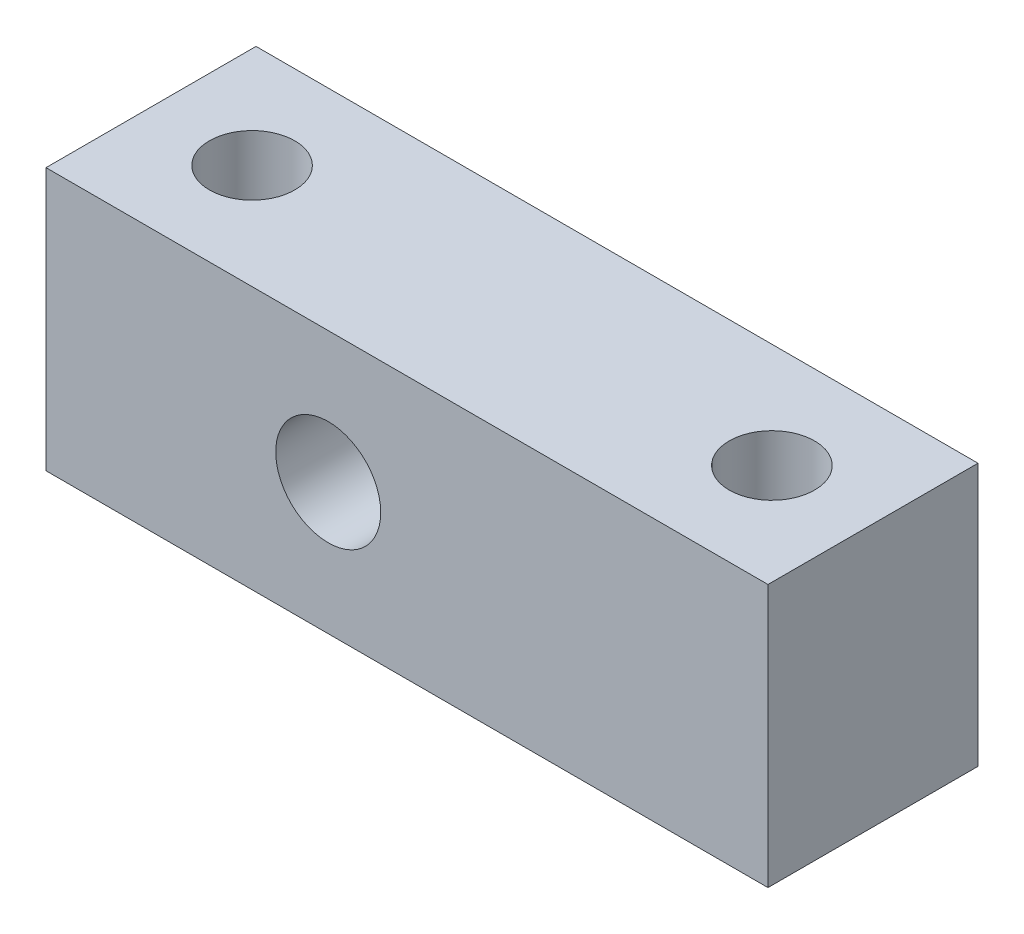
ISO-10303-21;
HEADER;
FILE_DESCRIPTION(('STEP AP214'),'2;1');
FILE_NAME('part.step','',(''),(''),'','','');
FILE_SCHEMA(('AUTOMOTIVE_DESIGN { 1 0 10303 214 1 1 1 1 }'));
ENDSEC;
DATA;
#1=APPLICATION_CONTEXT('core data for automotive mechanical design processes');
#2=APPLICATION_PROTOCOL_DEFINITION('international standard','automotive_design',2000,#1);
#3=PRODUCT_CONTEXT('',#1,'mechanical');
#4=PRODUCT('Part','Part','',(#3));
#5=PRODUCT_RELATED_PRODUCT_CATEGORY('part','',(#4));
#6=PRODUCT_DEFINITION_FORMATION('','',#4);
#7=PRODUCT_DEFINITION_CONTEXT('part definition',#1,'design');
#8=PRODUCT_DEFINITION('design','',#6,#7);
#9=PRODUCT_DEFINITION_SHAPE('','',#8);
#10=(LENGTH_UNIT() NAMED_UNIT(*) SI_UNIT(.MILLI.,.METRE.));
#11=(NAMED_UNIT(*) PLANE_ANGLE_UNIT() SI_UNIT($,.RADIAN.));
#12=(NAMED_UNIT(*) SI_UNIT($,.STERADIAN.) SOLID_ANGLE_UNIT());
#13=UNCERTAINTY_MEASURE_WITH_UNIT(LENGTH_MEASURE(1.E-05),#10,'distance_accuracy_value','');
#14=(GEOMETRIC_REPRESENTATION_CONTEXT(3) GLOBAL_UNCERTAINTY_ASSIGNED_CONTEXT((#13)) GLOBAL_UNIT_ASSIGNED_CONTEXT((#10,
#11,#12)) REPRESENTATION_CONTEXT('',''));
#15=CARTESIAN_POINT('',(0.,0.,0.));
#16=DIRECTION('',(0.,0.,1.));
#17=DIRECTION('',(1.,0.,0.));
#18=AXIS2_PLACEMENT_3D('',#15,#16,#17);
#19=CARTESIAN_POINT('',(27.5,-10.,16.));
#20=DIRECTION('',(-1.,0.,0.));
#21=DIRECTION('',(0.,0.,1.));
#22=AXIS2_PLACEMENT_3D('',#19,#20,#21);
#23=PLANE('',#22);
#24=DIRECTION('',(0.,1.,0.));
#25=VECTOR('',#24,1.);
#26=CARTESIAN_POINT('',(27.5,-10.,0.));
#27=LINE('',#26,#25);
#28=CARTESIAN_POINT('',(27.5,-10.,0.));
#29=VERTEX_POINT('',#28);
#30=CARTESIAN_POINT('',(27.5,10.,0.));
#31=VERTEX_POINT('',#30);
#32=EDGE_CURVE('E100',#29,#31,#27,.T.);
#33=ORIENTED_EDGE('',*,*,#32,.T.);
#34=DIRECTION('',(0.,0.,-1.));
#35=VECTOR('',#34,1.);
#36=CARTESIAN_POINT('',(27.5,10.,16.));
#37=LINE('',#36,#35);
#38=CARTESIAN_POINT('',(27.5,10.,16.));
#39=VERTEX_POINT('',#38);
#40=EDGE_CURVE('E11',#39,#31,#37,.T.);
#41=ORIENTED_EDGE('',*,*,#40,.F.);
#42=DIRECTION('',(0.,1.,0.));
#43=VECTOR('',#42,1.);
#44=CARTESIAN_POINT('',(27.5,-10.,16.));
#45=LINE('',#44,#43);
#46=CARTESIAN_POINT('',(27.5,-10.,16.));
#47=VERTEX_POINT('',#46);
#48=EDGE_CURVE('E87',#47,#39,#45,.T.);
#49=ORIENTED_EDGE('',*,*,#48,.F.);
#50=DIRECTION('',(0.,0.,-1.));
#51=VECTOR('',#50,1.);
#52=CARTESIAN_POINT('',(27.5,-10.,16.));
#53=LINE('',#52,#51);
#54=EDGE_CURVE('E96',#47,#29,#53,.T.);
#55=ORIENTED_EDGE('',*,*,#54,.T.);
#56=EDGE_LOOP('',(#33,#41,#49,#55));
#57=FACE_BOUND('',#56,.T.);
#58=ADVANCED_FACE('F35',(#57),#23,.F.);
#59=CARTESIAN_POINT('',(-27.5,10.,16.));
#60=DIRECTION('',(0.,-1.,0.));
#61=DIRECTION('',(0.,0.,-1.));
#62=AXIS2_PLACEMENT_3D('',#59,#60,#61);
#63=PLANE('',#62);
#64=CARTESIAN_POINT('',(19.8,10.,8.));
#65=DIRECTION('',(0.,1.,0.));
#66=DIRECTION('',(0.,0.,1.));
#67=AXIS2_PLACEMENT_3D('',#64,#65,#66);
#68=CIRCLE('',#67,3.25);
#69=CARTESIAN_POINT('',(19.8,10.,11.25));
#70=VERTEX_POINT('',#69);
#71=EDGE_CURVE('E125',#70,#70,#68,.T.);
#72=ORIENTED_EDGE('',*,*,#71,.F.);
#73=EDGE_LOOP('',(#72));
#74=FACE_BOUND('',#73,.T.);
#75=CARTESIAN_POINT('',(-19.8,10.,8.));
#76=DIRECTION('',(0.,1.,0.));
#77=DIRECTION('',(0.,0.,1.));
#78=AXIS2_PLACEMENT_3D('',#75,#76,#77);
#79=CIRCLE('',#78,3.25);
#80=CARTESIAN_POINT('',(-19.8,10.,11.25));
#81=VERTEX_POINT('',#80);
#82=EDGE_CURVE('E119',#81,#81,#79,.T.);
#83=ORIENTED_EDGE('',*,*,#82,.F.);
#84=EDGE_LOOP('',(#83));
#85=FACE_BOUND('',#84,.T.);
#86=DIRECTION('',(-1.,0.,0.));
#87=VECTOR('',#86,1.);
#88=CARTESIAN_POINT('',(-27.5,10.,0.));
#89=LINE('',#88,#87);
#90=CARTESIAN_POINT('',(-27.5,10.,0.));
#91=VERTEX_POINT('',#90);
#92=EDGE_CURVE('E91',#31,#91,#89,.T.);
#93=ORIENTED_EDGE('',*,*,#92,.T.);
#94=DIRECTION('',(0.,0.,-1.));
#95=VECTOR('',#94,1.);
#96=CARTESIAN_POINT('',(-27.5,10.,16.));
#97=LINE('',#96,#95);
#98=CARTESIAN_POINT('',(-27.5,10.,16.));
#99=VERTEX_POINT('',#98);
#100=EDGE_CURVE('E44',#99,#91,#97,.T.);
#101=ORIENTED_EDGE('',*,*,#100,.F.);
#102=DIRECTION('',(-1.,0.,0.));
#103=VECTOR('',#102,1.);
#104=CARTESIAN_POINT('',(-27.5,10.,16.));
#105=LINE('',#104,#103);
#106=EDGE_CURVE('E82',#39,#99,#105,.T.);
#107=ORIENTED_EDGE('',*,*,#106,.F.);
#108=ORIENTED_EDGE('',*,*,#40,.T.);
#109=EDGE_LOOP('',(#93,#101,#107,#108));
#110=FACE_BOUND('',#109,.T.);
#111=ADVANCED_FACE('F90',(#74,#85,#110),#63,.F.);
#112=CARTESIAN_POINT('',(-27.5,-10.,16.));
#113=DIRECTION('',(1.,0.,0.));
#114=DIRECTION('',(0.,0.,-1.));
#115=AXIS2_PLACEMENT_3D('',#112,#113,#114);
#116=PLANE('',#115);
#117=DIRECTION('',(0.,-1.,0.));
#118=VECTOR('',#117,1.);
#119=CARTESIAN_POINT('',(-27.5,-10.,0.));
#120=LINE('',#119,#118);
#121=CARTESIAN_POINT('',(-27.5,-10.,0.));
#122=VERTEX_POINT('',#121);
#123=EDGE_CURVE('E69',#91,#122,#120,.T.);
#124=ORIENTED_EDGE('',*,*,#123,.T.);
#125=DIRECTION('',(0.,0.,-1.));
#126=VECTOR('',#125,1.);
#127=CARTESIAN_POINT('',(-27.5,-10.,16.));
#128=LINE('',#127,#126);
#129=CARTESIAN_POINT('',(-27.5,-10.,16.));
#130=VERTEX_POINT('',#129);
#131=EDGE_CURVE('E92',#130,#122,#128,.T.);
#132=ORIENTED_EDGE('',*,*,#131,.F.);
#133=DIRECTION('',(0.,-1.,0.));
#134=VECTOR('',#133,1.);
#135=CARTESIAN_POINT('',(-27.5,-10.,16.));
#136=LINE('',#135,#134);
#137=EDGE_CURVE('E85',#99,#130,#136,.T.);
#138=ORIENTED_EDGE('',*,*,#137,.F.);
#139=ORIENTED_EDGE('',*,*,#100,.T.);
#140=EDGE_LOOP('',(#124,#132,#138,#139));
#141=FACE_BOUND('',#140,.T.);
#142=ADVANCED_FACE('F94',(#141),#116,.F.);
#143=CARTESIAN_POINT('',(-27.5,-10.,16.));
#144=DIRECTION('',(0.,1.,0.));
#145=DIRECTION('',(0.,0.,1.));
#146=AXIS2_PLACEMENT_3D('',#143,#144,#145);
#147=PLANE('',#146);
#148=CARTESIAN_POINT('',(19.8,-10.,8.));
#149=DIRECTION('',(0.,1.,0.));
#150=DIRECTION('',(0.,0.,1.));
#151=AXIS2_PLACEMENT_3D('',#148,#149,#150);
#152=CIRCLE('',#151,3.25);
#153=CARTESIAN_POINT('',(19.8,-10.,11.25));
#154=VERTEX_POINT('',#153);
#155=EDGE_CURVE('E122',#154,#154,#152,.T.);
#156=ORIENTED_EDGE('',*,*,#155,.T.);
#157=EDGE_LOOP('',(#156));
#158=FACE_BOUND('',#157,.T.);
#159=CARTESIAN_POINT('',(-19.8,-10.,8.));
#160=DIRECTION('',(0.,1.,0.));
#161=DIRECTION('',(0.,0.,1.));
#162=AXIS2_PLACEMENT_3D('',#159,#160,#161);
#163=CIRCLE('',#162,3.25);
#164=CARTESIAN_POINT('',(-19.8,-10.,11.25));
#165=VERTEX_POINT('',#164);
#166=EDGE_CURVE('E116',#165,#165,#163,.T.);
#167=ORIENTED_EDGE('',*,*,#166,.T.);
#168=EDGE_LOOP('',(#167));
#169=FACE_BOUND('',#168,.T.);
#170=DIRECTION('',(1.,0.,0.));
#171=VECTOR('',#170,1.);
#172=CARTESIAN_POINT('',(-27.5,-10.,0.));
#173=LINE('',#172,#171);
#174=EDGE_CURVE('E75',#122,#29,#173,.T.);
#175=ORIENTED_EDGE('',*,*,#174,.T.);
#176=ORIENTED_EDGE('',*,*,#54,.F.);
#177=DIRECTION('',(1.,0.,0.));
#178=VECTOR('',#177,1.);
#179=CARTESIAN_POINT('',(-27.5,-10.,16.));
#180=LINE('',#179,#178);
#181=EDGE_CURVE('E52',#130,#47,#180,.T.);
#182=ORIENTED_EDGE('',*,*,#181,.F.);
#183=ORIENTED_EDGE('',*,*,#131,.T.);
#184=EDGE_LOOP('',(#175,#176,#182,#183));
#185=FACE_BOUND('',#184,.T.);
#186=ADVANCED_FACE('F107',(#158,#169,#185),#147,.F.);
#187=CARTESIAN_POINT('',(0.,0.,16.));
#188=DIRECTION('',(0.,0.,-1.));
#189=DIRECTION('',(-1.,0.,0.));
#190=AXIS2_PLACEMENT_3D('',#187,#188,#189);
#191=PLANE('',#190);
#192=CARTESIAN_POINT('',(-6.,0.,16.));
#193=DIRECTION('',(0.,0.,1.));
#194=DIRECTION('',(1.,0.,0.));
#195=AXIS2_PLACEMENT_3D('',#192,#193,#194);
#196=CIRCLE('',#195,4.);
#197=CARTESIAN_POINT('',(-2.,0.,16.));
#198=VERTEX_POINT('',#197);
#199=EDGE_CURVE('E113',#198,#198,#196,.T.);
#200=ORIENTED_EDGE('',*,*,#199,.F.);
#201=EDGE_LOOP('',(#200));
#202=FACE_BOUND('',#201,.T.);
#203=ORIENTED_EDGE('',*,*,#48,.T.);
#204=ORIENTED_EDGE('',*,*,#106,.T.);
#205=ORIENTED_EDGE('',*,*,#137,.T.);
#206=ORIENTED_EDGE('',*,*,#181,.T.);
#207=EDGE_LOOP('',(#203,#204,#205,#206));
#208=FACE_BOUND('',#207,.T.);
#209=ADVANCED_FACE('F83',(#202,#208),#191,.F.);
#210=CARTESIAN_POINT('',(0.,0.,0.));
#211=DIRECTION('',(0.,0.,-1.));
#212=DIRECTION('',(-1.,0.,0.));
#213=AXIS2_PLACEMENT_3D('',#210,#211,#212);
#214=PLANE('',#213);
#215=CARTESIAN_POINT('',(-6.,0.,0.));
#216=DIRECTION('',(0.,0.,-1.));
#217=DIRECTION('',(-1.,0.,0.));
#218=AXIS2_PLACEMENT_3D('',#215,#216,#217);
#219=CIRCLE('',#218,4.);
#220=CARTESIAN_POINT('',(-10.,0.,0.));
#221=VERTEX_POINT('',#220);
#222=EDGE_CURVE('E38',#221,#221,#219,.T.);
#223=ORIENTED_EDGE('',*,*,#222,.F.);
#224=EDGE_LOOP('',(#223));
#225=FACE_BOUND('',#224,.T.);
#226=ORIENTED_EDGE('',*,*,#32,.F.);
#227=ORIENTED_EDGE('',*,*,#174,.F.);
#228=ORIENTED_EDGE('',*,*,#123,.F.);
#229=ORIENTED_EDGE('',*,*,#92,.F.);
#230=EDGE_LOOP('',(#226,#227,#228,#229));
#231=FACE_BOUND('',#230,.T.);
#232=ADVANCED_FACE('F110',(#225,#231),#214,.T.);
#233=CARTESIAN_POINT('',(-6.,0.,-2.));
#234=DIRECTION('',(0.,0.,1.));
#235=DIRECTION('',(1.,0.,0.));
#236=AXIS2_PLACEMENT_3D('',#233,#234,#235);
#237=CYLINDRICAL_SURFACE('',#236,4.);
#238=ORIENTED_EDGE('',*,*,#222,.T.);
#239=EDGE_LOOP('',(#238));
#240=FACE_BOUND('',#239,.T.);
#241=ORIENTED_EDGE('',*,*,#199,.T.);
#242=EDGE_LOOP('',(#241));
#243=FACE_BOUND('',#242,.T.);
#244=ADVANCED_FACE('F137',(#240,#243),#237,.F.);
#245=CARTESIAN_POINT('',(-19.8,10.,8.));
#246=DIRECTION('',(0.,1.,0.));
#247=DIRECTION('',(0.,0.,1.));
#248=AXIS2_PLACEMENT_3D('',#245,#246,#247);
#249=CYLINDRICAL_SURFACE('',#248,3.25);
#250=ORIENTED_EDGE('',*,*,#166,.F.);
#251=EDGE_LOOP('',(#250));
#252=FACE_BOUND('',#251,.T.);
#253=ORIENTED_EDGE('',*,*,#82,.T.);
#254=EDGE_LOOP('',(#253));
#255=FACE_BOUND('',#254,.T.);
#256=ADVANCED_FACE('F135',(#252,#255),#249,.F.);
#257=CARTESIAN_POINT('',(19.8,10.,8.));
#258=DIRECTION('',(0.,1.,0.));
#259=DIRECTION('',(0.,0.,1.));
#260=AXIS2_PLACEMENT_3D('',#257,#258,#259);
#261=CYLINDRICAL_SURFACE('',#260,3.25);
#262=ORIENTED_EDGE('',*,*,#155,.F.);
#263=EDGE_LOOP('',(#262));
#264=FACE_BOUND('',#263,.T.);
#265=ORIENTED_EDGE('',*,*,#71,.T.);
#266=EDGE_LOOP('',(#265));
#267=FACE_BOUND('',#266,.T.);
#268=ADVANCED_FACE('F129',(#264,#267),#261,.F.);
#269=CLOSED_SHELL('',(#58,#111,#142,#186,#209,#232,#244,#256,#268));
#270=MANIFOLD_SOLID_BREP('B2',#269);
#271=ADVANCED_BREP_SHAPE_REPRESENTATION('',(#18,#270),#14);
#272=SHAPE_DEFINITION_REPRESENTATION(#9,#271);
ENDSEC;
END-ISO-10303-21;
